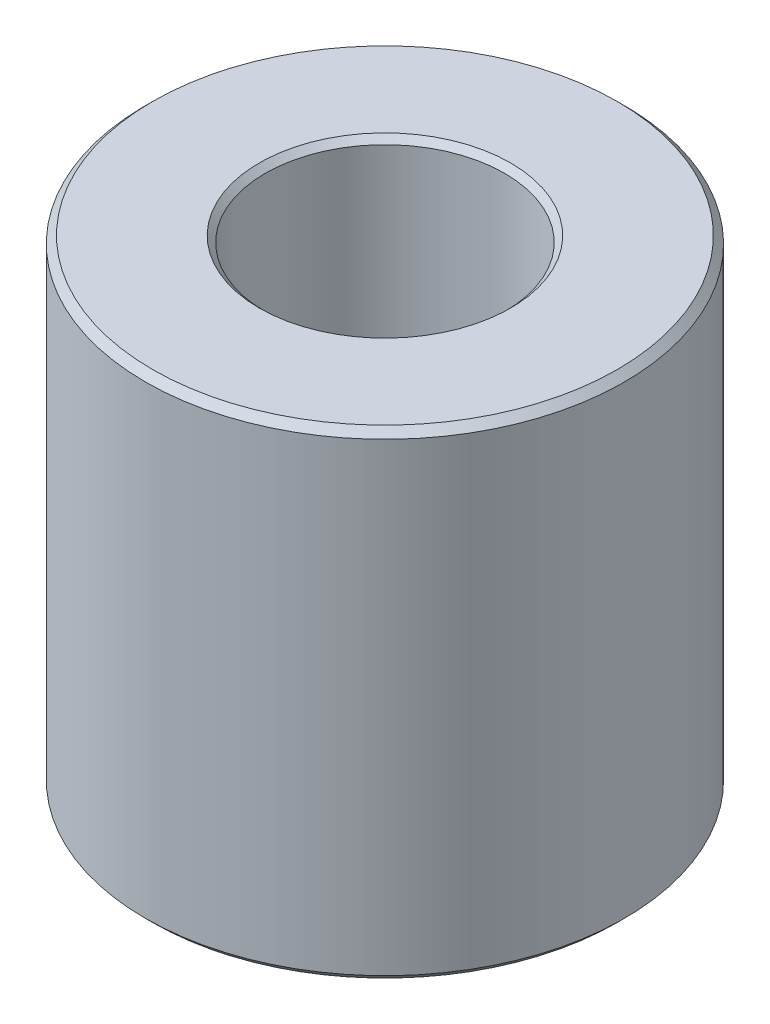
ISO-10303-21;
HEADER;
FILE_DESCRIPTION(('STEP AP214'),'2;1');
FILE_NAME('part.step','',(''),(''),'','','');
FILE_SCHEMA(('AUTOMOTIVE_DESIGN { 1 0 10303 214 1 1 1 1 }'));
ENDSEC;
DATA;
#1=APPLICATION_CONTEXT('core data for automotive mechanical design processes');
#2=APPLICATION_PROTOCOL_DEFINITION('international standard','automotive_design',2000,#1);
#3=PRODUCT_CONTEXT('',#1,'mechanical');
#4=PRODUCT('Part','Part','',(#3));
#5=PRODUCT_RELATED_PRODUCT_CATEGORY('part','',(#4));
#6=PRODUCT_DEFINITION_FORMATION('','',#4);
#7=PRODUCT_DEFINITION_CONTEXT('part definition',#1,'design');
#8=PRODUCT_DEFINITION('design','',#6,#7);
#9=PRODUCT_DEFINITION_SHAPE('','',#8);
#10=(LENGTH_UNIT() NAMED_UNIT(*) SI_UNIT(.MILLI.,.METRE.));
#11=(NAMED_UNIT(*) PLANE_ANGLE_UNIT() SI_UNIT($,.RADIAN.));
#12=(NAMED_UNIT(*) SI_UNIT($,.STERADIAN.) SOLID_ANGLE_UNIT());
#13=UNCERTAINTY_MEASURE_WITH_UNIT(LENGTH_MEASURE(1.E-05),#10,'distance_accuracy_value','');
#14=(GEOMETRIC_REPRESENTATION_CONTEXT(3) GLOBAL_UNCERTAINTY_ASSIGNED_CONTEXT((#13)) GLOBAL_UNIT_ASSIGNED_CONTEXT((#10,
#11,#12)) REPRESENTATION_CONTEXT('',''));
#15=CARTESIAN_POINT('',(0.,0.,0.));
#16=DIRECTION('',(0.,0.,1.));
#17=DIRECTION('',(1.,0.,0.));
#18=AXIS2_PLACEMENT_3D('',#15,#16,#17);
#19=CARTESIAN_POINT('',(0.,50.8,0.));
#20=DIRECTION('',(0.,-1.,0.));
#21=DIRECTION('',(0.,0.,-1.));
#22=AXIS2_PLACEMENT_3D('',#19,#20,#21);
#23=CYLINDRICAL_SURFACE('',#22,25.4);
#24=CARTESIAN_POINT('',(0.,0.761999999999985,0.));
#25=DIRECTION('',(0.,1.,0.));
#26=DIRECTION('',(0.,0.,1.));
#27=AXIS2_PLACEMENT_3D('',#24,#25,#26);
#28=CIRCLE('',#27,25.4);
#29=CARTESIAN_POINT('',(0.,0.761999999999985,25.4));
#30=VERTEX_POINT('',#29);
#31=EDGE_CURVE('E57',#30,#30,#28,.T.);
#32=ORIENTED_EDGE('',*,*,#31,.T.);
#33=EDGE_LOOP('',(#32));
#34=FACE_BOUND('',#33,.T.);
#35=CARTESIAN_POINT('',(0.,50.038,0.));
#36=DIRECTION('',(0.,1.,0.));
#37=DIRECTION('',(0.,0.,1.));
#38=AXIS2_PLACEMENT_3D('',#35,#36,#37);
#39=CIRCLE('',#38,25.4);
#40=CARTESIAN_POINT('',(0.,50.038,25.4));
#41=VERTEX_POINT('',#40);
#42=EDGE_CURVE('E60',#41,#41,#39,.F.);
#43=ORIENTED_EDGE('',*,*,#42,.T.);
#44=EDGE_LOOP('',(#43));
#45=FACE_BOUND('',#44,.T.);
#46=ADVANCED_FACE('F30',(#34,#45),#23,.T.);
#47=CARTESIAN_POINT('',(0.,50.8,0.));
#48=DIRECTION('',(0.,1.,0.));
#49=DIRECTION('',(0.,0.,1.));
#50=AXIS2_PLACEMENT_3D('',#47,#48,#49);
#51=PLANE('',#50);
#52=CARTESIAN_POINT('',(0.,50.8,0.));
#53=DIRECTION('',(0.,1.,0.));
#54=DIRECTION('',(0.,0.,1.));
#55=AXIS2_PLACEMENT_3D('',#52,#53,#54);
#56=CIRCLE('',#55,13.335);
#57=CARTESIAN_POINT('',(0.,50.8,13.335));
#58=VERTEX_POINT('',#57);
#59=EDGE_CURVE('E10',#58,#58,#56,.F.);
#60=ORIENTED_EDGE('',*,*,#59,.T.);
#61=EDGE_LOOP('',(#60));
#62=FACE_BOUND('',#61,.T.);
#63=CARTESIAN_POINT('',(0.,50.8,0.));
#64=DIRECTION('',(0.,1.,0.));
#65=DIRECTION('',(0.,0.,1.));
#66=AXIS2_PLACEMENT_3D('',#63,#64,#65);
#67=CIRCLE('',#66,24.638);
#68=CARTESIAN_POINT('',(0.,50.8,24.638));
#69=VERTEX_POINT('',#68);
#70=EDGE_CURVE('E50',#69,#69,#67,.T.);
#71=ORIENTED_EDGE('',*,*,#70,.T.);
#72=EDGE_LOOP('',(#71));
#73=FACE_BOUND('',#72,.T.);
#74=ADVANCED_FACE('F84',(#62,#73),#51,.T.);
#75=CARTESIAN_POINT('',(0.,0.,0.));
#76=DIRECTION('',(0.,1.,0.));
#77=DIRECTION('',(0.,0.,1.));
#78=AXIS2_PLACEMENT_3D('',#75,#76,#77);
#79=PLANE('',#78);
#80=CARTESIAN_POINT('',(0.,0.,0.));
#81=DIRECTION('',(0.,1.,0.));
#82=DIRECTION('',(0.,0.,1.));
#83=AXIS2_PLACEMENT_3D('',#80,#81,#82);
#84=CIRCLE('',#83,7.12469999999999);
#85=CARTESIAN_POINT('',(0.,0.,7.12469999999999));
#86=VERTEX_POINT('',#85);
#87=EDGE_CURVE('E66',#86,#86,#84,.T.);
#88=ORIENTED_EDGE('',*,*,#87,.T.);
#89=EDGE_LOOP('',(#88));
#90=FACE_BOUND('',#89,.T.);
#91=CARTESIAN_POINT('',(0.,0.,0.));
#92=DIRECTION('',(0.,1.,0.));
#93=DIRECTION('',(0.,0.,1.));
#94=AXIS2_PLACEMENT_3D('',#91,#92,#93);
#95=CIRCLE('',#94,24.638);
#96=CARTESIAN_POINT('',(0.,0.,24.638));
#97=VERTEX_POINT('',#96);
#98=EDGE_CURVE('E54',#97,#97,#95,.F.);
#99=ORIENTED_EDGE('',*,*,#98,.T.);
#100=EDGE_LOOP('',(#99));
#101=FACE_BOUND('',#100,.T.);
#102=ADVANCED_FACE('F72',(#90,#101),#79,.F.);
#103=CARTESIAN_POINT('',(0.,50.8,0.));
#104=DIRECTION('',(0.,1.,0.));
#105=DIRECTION('',(0.,0.,1.));
#106=AXIS2_PLACEMENT_3D('',#103,#104,#105);
#107=CYLINDRICAL_SURFACE('',#106,6.36269999999999);
#108=CARTESIAN_POINT('',(0.,8.382,0.));
#109=DIRECTION('',(0.,-1.,0.));
#110=DIRECTION('',(0.,0.,-1.));
#111=AXIS2_PLACEMENT_3D('',#108,#109,#110);
#112=CIRCLE('',#111,6.36269999999999);
#113=CARTESIAN_POINT('',(0.,8.382,-6.36269999999999));
#114=VERTEX_POINT('',#113);
#115=EDGE_CURVE('E51',#114,#114,#112,.F.);
#116=ORIENTED_EDGE('',*,*,#115,.T.);
#117=EDGE_LOOP('',(#116));
#118=FACE_BOUND('',#117,.T.);
#119=CARTESIAN_POINT('',(0.,0.762000000000013,0.));
#120=DIRECTION('',(0.,1.,0.));
#121=DIRECTION('',(0.,0.,1.));
#122=AXIS2_PLACEMENT_3D('',#119,#120,#121);
#123=CIRCLE('',#122,6.36269999999999);
#124=CARTESIAN_POINT('',(0.,0.762000000000013,6.36269999999999));
#125=VERTEX_POINT('',#124);
#126=EDGE_CURVE('E63',#125,#125,#123,.F.);
#127=ORIENTED_EDGE('',*,*,#126,.T.);
#128=EDGE_LOOP('',(#127));
#129=FACE_BOUND('',#128,.T.);
#130=ADVANCED_FACE('F99',(#118,#129),#107,.F.);
#131=CARTESIAN_POINT('',(0.,0.,0.));
#132=DIRECTION('',(0.,-1.,0.));
#133=DIRECTION('',(0.,0.,-1.));
#134=AXIS2_PLACEMENT_3D('',#131,#132,#133);
#135=CONICAL_SURFACE('',#134,7.12469999999999,0.785398163397439);
#136=ORIENTED_EDGE('',*,*,#126,.F.);
#137=EDGE_LOOP('',(#136));
#138=FACE_BOUND('',#137,.T.);
#139=ORIENTED_EDGE('',*,*,#87,.F.);
#140=EDGE_LOOP('',(#139));
#141=FACE_BOUND('',#140,.T.);
#142=ADVANCED_FACE('F78',(#138,#141),#135,.F.);
#143=CARTESIAN_POINT('',(0.,0.761999999999985,0.));
#144=DIRECTION('',(0.,1.,0.));
#145=DIRECTION('',(0.,0.,1.));
#146=AXIS2_PLACEMENT_3D('',#143,#144,#145);
#147=CONICAL_SURFACE('',#146,25.4,0.785398163397451);
#148=ORIENTED_EDGE('',*,*,#98,.F.);
#149=EDGE_LOOP('',(#148));
#150=FACE_BOUND('',#149,.T.);
#151=ORIENTED_EDGE('',*,*,#31,.F.);
#152=EDGE_LOOP('',(#151));
#153=FACE_BOUND('',#152,.T.);
#154=ADVANCED_FACE('F74',(#150,#153),#147,.T.);
#155=CARTESIAN_POINT('',(0.,50.8,0.));
#156=DIRECTION('',(0.,-1.,0.));
#157=DIRECTION('',(0.,0.,-1.));
#158=AXIS2_PLACEMENT_3D('',#155,#156,#157);
#159=CONICAL_SURFACE('',#158,24.638,0.785398163397453);
#160=ORIENTED_EDGE('',*,*,#42,.F.);
#161=EDGE_LOOP('',(#160));
#162=FACE_BOUND('',#161,.T.);
#163=ORIENTED_EDGE('',*,*,#70,.F.);
#164=EDGE_LOOP('',(#163));
#165=FACE_BOUND('',#164,.T.);
#166=ADVANCED_FACE('F77',(#162,#165),#159,.T.);
#167=CARTESIAN_POINT('',(0.,8.382,0.));
#168=DIRECTION('',(0.,-1.,0.));
#169=DIRECTION('',(0.,0.,-1.));
#170=AXIS2_PLACEMENT_3D('',#167,#168,#169);
#171=PLANE('',#170);
#172=CARTESIAN_POINT('',(0.,8.382,0.));
#173=DIRECTION('',(0.,-1.,0.));
#174=DIRECTION('',(0.,0.,-1.));
#175=AXIS2_PLACEMENT_3D('',#172,#173,#174);
#176=CIRCLE('',#175,12.446);
#177=CARTESIAN_POINT('',(0.,8.382,-12.446));
#178=VERTEX_POINT('',#177);
#179=EDGE_CURVE('E45',#178,#178,#176,.F.);
#180=ORIENTED_EDGE('',*,*,#179,.T.);
#181=EDGE_LOOP('',(#180));
#182=FACE_BOUND('',#181,.T.);
#183=ORIENTED_EDGE('',*,*,#115,.F.);
#184=EDGE_LOOP('',(#183));
#185=FACE_BOUND('',#184,.T.);
#186=ADVANCED_FACE('F90',(#182,#185),#171,.F.);
#187=CARTESIAN_POINT('',(0.,50.8,0.));
#188=DIRECTION('',(0.,1.,0.));
#189=DIRECTION('',(0.,0.,1.));
#190=AXIS2_PLACEMENT_3D('',#187,#188,#189);
#191=CYLINDRICAL_SURFACE('',#190,12.7);
#192=CARTESIAN_POINT('',(0.,50.165,0.));
#193=DIRECTION('',(0.,1.,0.));
#194=DIRECTION('',(0.,0.,1.));
#195=AXIS2_PLACEMENT_3D('',#192,#193,#194);
#196=CIRCLE('',#195,12.7);
#197=CARTESIAN_POINT('',(0.,50.165,12.7));
#198=VERTEX_POINT('',#197);
#199=EDGE_CURVE('E37',#198,#198,#196,.T.);
#200=ORIENTED_EDGE('',*,*,#199,.T.);
#201=EDGE_LOOP('',(#200));
#202=FACE_BOUND('',#201,.T.);
#203=CARTESIAN_POINT('',(0.,8.636,0.));
#204=DIRECTION('',(0.,-1.,0.));
#205=DIRECTION('',(0.,0.,-1.));
#206=AXIS2_PLACEMENT_3D('',#203,#204,#205);
#207=CIRCLE('',#206,12.7);
#208=CARTESIAN_POINT('',(0.,8.636,-12.7));
#209=VERTEX_POINT('',#208);
#210=EDGE_CURVE('E41',#209,#209,#207,.T.);
#211=ORIENTED_EDGE('',*,*,#210,.T.);
#212=EDGE_LOOP('',(#211));
#213=FACE_BOUND('',#212,.T.);
#214=ADVANCED_FACE('F109',(#202,#213),#191,.F.);
#215=CARTESIAN_POINT('',(0.,8.382,0.));
#216=DIRECTION('',(0.,1.,0.));
#217=DIRECTION('',(0.,0.,1.));
#218=AXIS2_PLACEMENT_3D('',#215,#216,#217);
#219=CONICAL_SURFACE('',#218,12.446,0.785398163397455);
#220=ORIENTED_EDGE('',*,*,#210,.F.);
#221=EDGE_LOOP('',(#220));
#222=FACE_BOUND('',#221,.T.);
#223=ORIENTED_EDGE('',*,*,#179,.F.);
#224=EDGE_LOOP('',(#223));
#225=FACE_BOUND('',#224,.T.);
#226=ADVANCED_FACE('F107',(#222,#225),#219,.F.);
#227=CARTESIAN_POINT('',(0.,50.165,0.));
#228=DIRECTION('',(0.,1.,0.));
#229=DIRECTION('',(0.,0.,1.));
#230=AXIS2_PLACEMENT_3D('',#227,#228,#229);
#231=CONICAL_SURFACE('',#230,12.7,0.785398163397446);
#232=ORIENTED_EDGE('',*,*,#59,.F.);
#233=EDGE_LOOP('',(#232));
#234=FACE_BOUND('',#233,.T.);
#235=ORIENTED_EDGE('',*,*,#199,.F.);
#236=EDGE_LOOP('',(#235));
#237=FACE_BOUND('',#236,.T.);
#238=ADVANCED_FACE('F32',(#234,#237),#231,.F.);
#239=CLOSED_SHELL('',(#46,#74,#102,#130,#142,#154,#166,#186,#214,#226,#238));
#240=MANIFOLD_SOLID_BREP('B2',#239);
#241=ADVANCED_BREP_SHAPE_REPRESENTATION('',(#18,#240),#14);
#242=SHAPE_DEFINITION_REPRESENTATION(#9,#241);
ENDSEC;
END-ISO-10303-21;
